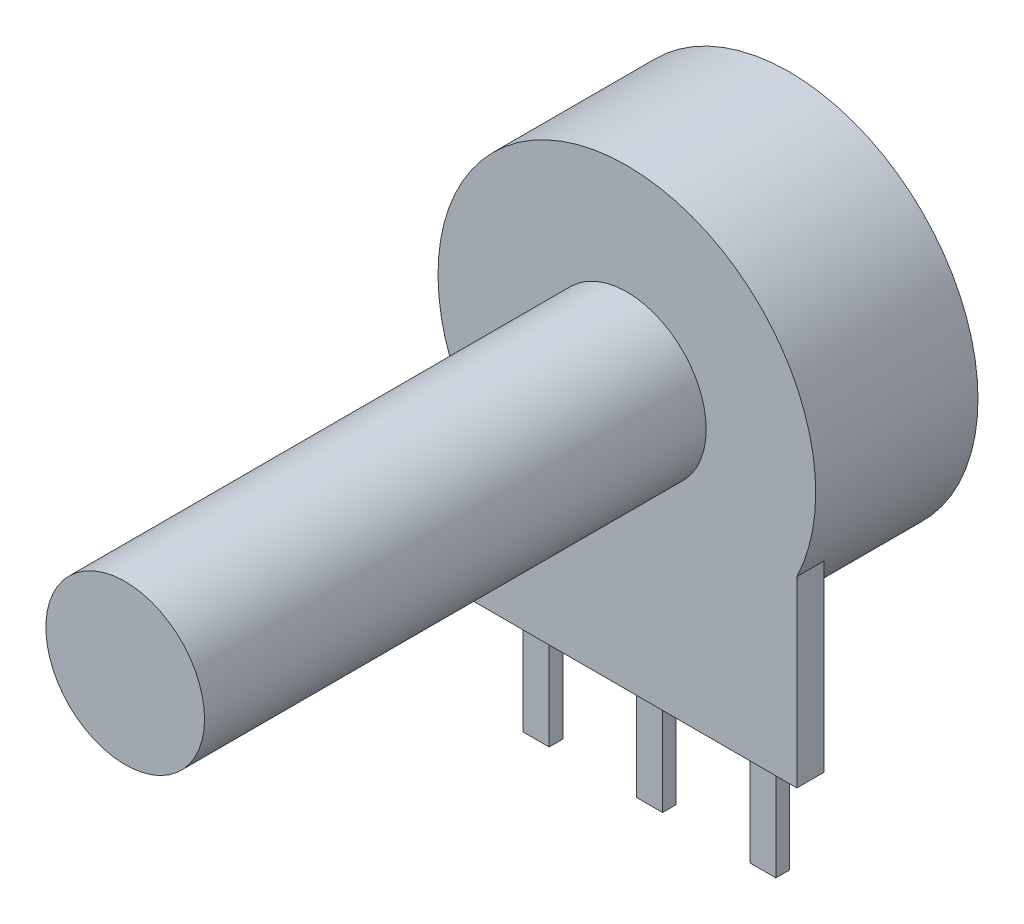
ISO-10303-21;
HEADER;
FILE_DESCRIPTION(('STEP AP214'),'2;1');
FILE_NAME('part.step','',(''),(''),'','','');
FILE_SCHEMA(('AUTOMOTIVE_DESIGN { 1 0 10303 214 1 1 1 1 }'));
ENDSEC;
DATA;
#1=APPLICATION_CONTEXT('core data for automotive mechanical design processes');
#2=APPLICATION_PROTOCOL_DEFINITION('international standard','automotive_design',2000,#1);
#3=PRODUCT_CONTEXT('',#1,'mechanical');
#4=PRODUCT('Part','Part','',(#3));
#5=PRODUCT_RELATED_PRODUCT_CATEGORY('part','',(#4));
#6=PRODUCT_DEFINITION_FORMATION('','',#4);
#7=PRODUCT_DEFINITION_CONTEXT('part definition',#1,'design');
#8=PRODUCT_DEFINITION('design','',#6,#7);
#9=PRODUCT_DEFINITION_SHAPE('','',#8);
#10=(LENGTH_UNIT() NAMED_UNIT(*) SI_UNIT(.MILLI.,.METRE.));
#11=(NAMED_UNIT(*) PLANE_ANGLE_UNIT() SI_UNIT($,.RADIAN.));
#12=(NAMED_UNIT(*) SI_UNIT($,.STERADIAN.) SOLID_ANGLE_UNIT());
#13=UNCERTAINTY_MEASURE_WITH_UNIT(LENGTH_MEASURE(1.E-05),#10,'distance_accuracy_value','');
#14=(GEOMETRIC_REPRESENTATION_CONTEXT(3) GLOBAL_UNCERTAINTY_ASSIGNED_CONTEXT((#13)) GLOBAL_UNIT_ASSIGNED_CONTEXT((#10,
#11,#12)) REPRESENTATION_CONTEXT('',''));
#15=CARTESIAN_POINT('',(0.,0.,0.));
#16=DIRECTION('',(0.,0.,1.));
#17=DIRECTION('',(1.,0.,0.));
#18=AXIS2_PLACEMENT_3D('',#15,#16,#17);
#19=CARTESIAN_POINT('',(0.,0.,7.16));
#20=DIRECTION('',(0.,0.,-1.));
#21=DIRECTION('',(-1.,0.,0.));
#22=AXIS2_PLACEMENT_3D('',#19,#20,#21);
#23=CYLINDRICAL_SURFACE('',#22,8.33);
#24=CARTESIAN_POINT('',(0.,0.,7.16));
#25=DIRECTION('',(0.,0.,1.));
#26=DIRECTION('',(1.,0.,0.));
#27=AXIS2_PLACEMENT_3D('',#24,#25,#26);
#28=CIRCLE('',#27,8.33);
#29=CARTESIAN_POINT('',(7.5,-3.62476206115657,7.16));
#30=VERTEX_POINT('',#29);
#31=CARTESIAN_POINT('',(-7.5,-3.62476206115657,7.16));
#32=VERTEX_POINT('',#31);
#33=EDGE_CURVE('E307',#30,#32,#28,.T.);
#34=ORIENTED_EDGE('',*,*,#33,.F.);
#35=DIRECTION('',(0.,0.,-1.));
#36=VECTOR('',#35,1.);
#37=CARTESIAN_POINT('',(7.5,-3.62476206115657,7.16));
#38=LINE('',#37,#36);
#39=CARTESIAN_POINT('',(7.5,-3.62476206115657,5.96));
#40=VERTEX_POINT('',#39);
#41=EDGE_CURVE('E297',#30,#40,#38,.T.);
#42=ORIENTED_EDGE('',*,*,#41,.T.);
#43=CARTESIAN_POINT('',(0.,0.,5.96));
#44=DIRECTION('',(0.,0.,-1.));
#45=DIRECTION('',(-1.,0.,0.));
#46=AXIS2_PLACEMENT_3D('',#43,#44,#45);
#47=CIRCLE('',#46,8.33);
#48=CARTESIAN_POINT('',(-7.5,-3.62476206115657,5.96));
#49=VERTEX_POINT('',#48);
#50=EDGE_CURVE('E37',#40,#49,#47,.T.);
#51=ORIENTED_EDGE('',*,*,#50,.T.);
#52=DIRECTION('',(0.,0.,-1.));
#53=VECTOR('',#52,1.);
#54=CARTESIAN_POINT('',(-7.5,-3.62476206115657,7.16));
#55=LINE('',#54,#53);
#56=EDGE_CURVE('E292',#49,#32,#55,.F.);
#57=ORIENTED_EDGE('',*,*,#56,.T.);
#58=EDGE_LOOP('',(#34,#42,#51,#57));
#59=FACE_BOUND('',#58,.T.);
#60=CARTESIAN_POINT('',(0.,0.,0.));
#61=DIRECTION('',(0.,0.,1.));
#62=DIRECTION('',(1.,0.,0.));
#63=AXIS2_PLACEMENT_3D('',#60,#61,#62);
#64=CIRCLE('',#63,8.33);
#65=CARTESIAN_POINT('',(8.33,0.,0.));
#66=VERTEX_POINT('',#65);
#67=EDGE_CURVE('E303',#66,#66,#64,.T.);
#68=ORIENTED_EDGE('',*,*,#67,.T.);
#69=EDGE_LOOP('',(#68));
#70=FACE_BOUND('',#69,.T.);
#71=ADVANCED_FACE('F34',(#59,#70),#23,.T.);
#72=CARTESIAN_POINT('',(0.,0.,7.16));
#73=DIRECTION('',(0.,0.,1.));
#74=DIRECTION('',(1.,0.,0.));
#75=AXIS2_PLACEMENT_3D('',#72,#73,#74);
#76=PLANE('',#75);
#77=ORIENTED_EDGE('',*,*,#33,.T.);
#78=DIRECTION('',(0.,-1.,0.));
#79=VECTOR('',#78,1.);
#80=CARTESIAN_POINT('',(-7.5,-11.7,7.16));
#81=LINE('',#80,#79);
#82=CARTESIAN_POINT('',(-7.5,-11.7,7.16));
#83=VERTEX_POINT('',#82);
#84=EDGE_CURVE('E286',#32,#83,#81,.T.);
#85=ORIENTED_EDGE('',*,*,#84,.T.);
#86=DIRECTION('',(1.,0.,0.));
#87=VECTOR('',#86,1.);
#88=CARTESIAN_POINT('',(-7.5,-11.7,7.16));
#89=LINE('',#88,#87);
#90=CARTESIAN_POINT('',(7.5,-11.7,7.16));
#91=VERTEX_POINT('',#90);
#92=EDGE_CURVE('E276',#83,#91,#89,.T.);
#93=ORIENTED_EDGE('',*,*,#92,.T.);
#94=DIRECTION('',(0.,1.,0.));
#95=VECTOR('',#94,1.);
#96=CARTESIAN_POINT('',(7.5,-11.7,7.16));
#97=LINE('',#96,#95);
#98=EDGE_CURVE('E271',#91,#30,#97,.T.);
#99=ORIENTED_EDGE('',*,*,#98,.T.);
#100=EDGE_LOOP('',(#77,#85,#93,#99));
#101=FACE_BOUND('',#100,.T.);
#102=CARTESIAN_POINT('',(0.,0.,7.16));
#103=DIRECTION('',(0.,0.,1.));
#104=DIRECTION('',(1.,0.,0.));
#105=AXIS2_PLACEMENT_3D('',#102,#103,#104);
#106=CIRCLE('',#105,3.5);
#107=CARTESIAN_POINT('',(3.5,0.,7.16));
#108=VERTEX_POINT('',#107);
#109=EDGE_CURVE('E304',#108,#108,#106,.T.);
#110=ORIENTED_EDGE('',*,*,#109,.F.);
#111=EDGE_LOOP('',(#110));
#112=FACE_BOUND('',#111,.T.);
#113=ADVANCED_FACE('F316',(#101,#112),#76,.T.);
#114=CARTESIAN_POINT('',(0.,0.,0.));
#115=DIRECTION('',(0.,0.,1.));
#116=DIRECTION('',(1.,0.,0.));
#117=AXIS2_PLACEMENT_3D('',#114,#115,#116);
#118=PLANE('',#117);
#119=ORIENTED_EDGE('',*,*,#67,.F.);
#120=EDGE_LOOP('',(#119));
#121=FACE_BOUND('',#120,.T.);
#122=ADVANCED_FACE('F313',(#121),#118,.F.);
#123=CARTESIAN_POINT('',(0.,0.,29.29));
#124=DIRECTION('',(0.,0.,-1.));
#125=DIRECTION('',(-1.,0.,0.));
#126=AXIS2_PLACEMENT_3D('',#123,#124,#125);
#127=CYLINDRICAL_SURFACE('',#126,3.5);
#128=CARTESIAN_POINT('',(0.,0.,29.29));
#129=DIRECTION('',(0.,0.,1.));
#130=DIRECTION('',(1.,0.,0.));
#131=AXIS2_PLACEMENT_3D('',#128,#129,#130);
#132=CIRCLE('',#131,3.5);
#133=CARTESIAN_POINT('',(3.5,0.,29.29));
#134=VERTEX_POINT('',#133);
#135=EDGE_CURVE('E300',#134,#134,#132,.T.);
#136=ORIENTED_EDGE('',*,*,#135,.F.);
#137=EDGE_LOOP('',(#136));
#138=FACE_BOUND('',#137,.T.);
#139=ORIENTED_EDGE('',*,*,#109,.T.);
#140=EDGE_LOOP('',(#139));
#141=FACE_BOUND('',#140,.T.);
#142=ADVANCED_FACE('F315',(#138,#141),#127,.T.);
#143=CARTESIAN_POINT('',(0.,0.,29.29));
#144=DIRECTION('',(0.,0.,1.));
#145=DIRECTION('',(1.,0.,0.));
#146=AXIS2_PLACEMENT_3D('',#143,#144,#145);
#147=PLANE('',#146);
#148=ORIENTED_EDGE('',*,*,#135,.T.);
#149=EDGE_LOOP('',(#148));
#150=FACE_BOUND('',#149,.T.);
#151=ADVANCED_FACE('F321',(#150),#147,.T.);
#152=CARTESIAN_POINT('',(7.5,-11.7,5.96));
#153=DIRECTION('',(1.,0.,0.));
#154=DIRECTION('',(0.,0.,-1.));
#155=AXIS2_PLACEMENT_3D('',#152,#153,#154);
#156=PLANE('',#155);
#157=ORIENTED_EDGE('',*,*,#41,.F.);
#158=ORIENTED_EDGE('',*,*,#98,.F.);
#159=DIRECTION('',(0.,0.,1.));
#160=VECTOR('',#159,1.);
#161=CARTESIAN_POINT('',(7.5,-11.7,5.96));
#162=LINE('',#161,#160);
#163=CARTESIAN_POINT('',(7.5,-11.7,5.96));
#164=VERTEX_POINT('',#163);
#165=EDGE_CURVE('E290',#164,#91,#162,.T.);
#166=ORIENTED_EDGE('',*,*,#165,.F.);
#167=DIRECTION('',(0.,1.,0.));
#168=VECTOR('',#167,1.);
#169=CARTESIAN_POINT('',(7.5,-11.7,5.96));
#170=LINE('',#169,#168);
#171=EDGE_CURVE('E272',#164,#40,#170,.T.);
#172=ORIENTED_EDGE('',*,*,#171,.T.);
#173=EDGE_LOOP('',(#157,#158,#166,#172));
#174=FACE_BOUND('',#173,.T.);
#175=ADVANCED_FACE('F338',(#174),#156,.T.);
#176=CARTESIAN_POINT('',(-7.5,-11.7,5.96));
#177=DIRECTION('',(-1.,0.,0.));
#178=DIRECTION('',(0.,0.,1.));
#179=AXIS2_PLACEMENT_3D('',#176,#177,#178);
#180=PLANE('',#179);
#181=ORIENTED_EDGE('',*,*,#56,.F.);
#182=DIRECTION('',(0.,-1.,0.));
#183=VECTOR('',#182,1.);
#184=CARTESIAN_POINT('',(-7.5,-11.7,5.96));
#185=LINE('',#184,#183);
#186=CARTESIAN_POINT('',(-7.5,-11.7,5.96));
#187=VERTEX_POINT('',#186);
#188=EDGE_CURVE('E275',#49,#187,#185,.T.);
#189=ORIENTED_EDGE('',*,*,#188,.T.);
#190=DIRECTION('',(0.,0.,1.));
#191=VECTOR('',#190,1.);
#192=CARTESIAN_POINT('',(-7.5,-11.7,5.96));
#193=LINE('',#192,#191);
#194=EDGE_CURVE('E282',#187,#83,#193,.T.);
#195=ORIENTED_EDGE('',*,*,#194,.T.);
#196=ORIENTED_EDGE('',*,*,#84,.F.);
#197=EDGE_LOOP('',(#181,#189,#195,#196));
#198=FACE_BOUND('',#197,.T.);
#199=ADVANCED_FACE('F383',(#198),#180,.T.);
#200=CARTESIAN_POINT('',(-7.5,-11.7,5.96));
#201=DIRECTION('',(0.,-1.,0.));
#202=DIRECTION('',(1.,0.,0.));
#203=AXIS2_PLACEMENT_3D('',#200,#201,#202);
#204=PLANE('',#203);
#205=DIRECTION('',(0.,0.,1.));
#206=VECTOR('',#205,1.);
#207=CARTESIAN_POINT('',(4.425,-11.7,5.56));
#208=LINE('',#207,#206);
#209=CARTESIAN_POINT('',(4.425,-11.7,5.96));
#210=VERTEX_POINT('',#209);
#211=CARTESIAN_POINT('',(4.425,-11.7,6.16));
#212=VERTEX_POINT('',#211);
#213=EDGE_CURVE('E56',#210,#212,#208,.T.);
#214=ORIENTED_EDGE('',*,*,#213,.T.);
#215=DIRECTION('',(-1.,0.,0.));
#216=VECTOR('',#215,1.);
#217=CARTESIAN_POINT('',(5.,-11.7,6.16));
#218=LINE('',#217,#216);
#219=CARTESIAN_POINT('',(5.575,-11.7,6.16));
#220=VERTEX_POINT('',#219);
#221=EDGE_CURVE('E51',#220,#212,#218,.T.);
#222=ORIENTED_EDGE('',*,*,#221,.F.);
#223=DIRECTION('',(0.,0.,1.));
#224=VECTOR('',#223,1.);
#225=CARTESIAN_POINT('',(5.575,-11.7,5.56));
#226=LINE('',#225,#224);
#227=CARTESIAN_POINT('',(5.575,-11.7,5.96));
#228=VERTEX_POINT('',#227);
#229=EDGE_CURVE('E207',#228,#220,#226,.T.);
#230=ORIENTED_EDGE('',*,*,#229,.F.);
#231=DIRECTION('',(1.,0.,0.));
#232=VECTOR('',#231,1.);
#233=CARTESIAN_POINT('',(-7.5,-11.7,5.96));
#234=LINE('',#233,#232);
#235=EDGE_CURVE('E278',#228,#164,#234,.T.);
#236=ORIENTED_EDGE('',*,*,#235,.T.);
#237=ORIENTED_EDGE('',*,*,#165,.T.);
#238=ORIENTED_EDGE('',*,*,#92,.F.);
#239=ORIENTED_EDGE('',*,*,#194,.F.);
#240=CARTESIAN_POINT('',(-5.575,-11.7,5.96));
#241=VERTEX_POINT('',#240);
#242=EDGE_CURVE('E279',#187,#241,#234,.T.);
#243=ORIENTED_EDGE('',*,*,#242,.T.);
#244=DIRECTION('',(0.,0.,1.));
#245=VECTOR('',#244,1.);
#246=CARTESIAN_POINT('',(-5.575,-11.7,5.56));
#247=LINE('',#246,#245);
#248=CARTESIAN_POINT('',(-5.575,-11.7,6.16));
#249=VERTEX_POINT('',#248);
#250=EDGE_CURVE('E238',#241,#249,#247,.T.);
#251=ORIENTED_EDGE('',*,*,#250,.T.);
#252=DIRECTION('',(-1.,0.,0.));
#253=VECTOR('',#252,1.);
#254=CARTESIAN_POINT('',(-5.,-11.7,6.16));
#255=LINE('',#254,#253);
#256=CARTESIAN_POINT('',(-4.425,-11.7,6.16));
#257=VERTEX_POINT('',#256);
#258=EDGE_CURVE('E223',#257,#249,#255,.T.);
#259=ORIENTED_EDGE('',*,*,#258,.F.);
#260=DIRECTION('',(0.,0.,1.));
#261=VECTOR('',#260,1.);
#262=CARTESIAN_POINT('',(-4.425,-11.7,5.56));
#263=LINE('',#262,#261);
#264=CARTESIAN_POINT('',(-4.425,-11.7,5.96));
#265=VERTEX_POINT('',#264);
#266=EDGE_CURVE('E234',#265,#257,#263,.T.);
#267=ORIENTED_EDGE('',*,*,#266,.F.);
#268=CARTESIAN_POINT('',(-0.575,-11.7,5.96));
#269=VERTEX_POINT('',#268);
#270=EDGE_CURVE('E350',#265,#269,#234,.T.);
#271=ORIENTED_EDGE('',*,*,#270,.T.);
#272=DIRECTION('',(0.,0.,1.));
#273=VECTOR('',#272,1.);
#274=CARTESIAN_POINT('',(-0.575,-11.7,5.56));
#275=LINE('',#274,#273);
#276=CARTESIAN_POINT('',(-0.575,-11.7,6.16));
#277=VERTEX_POINT('',#276);
#278=EDGE_CURVE('E42',#269,#277,#275,.T.);
#279=ORIENTED_EDGE('',*,*,#278,.T.);
#280=DIRECTION('',(-1.,0.,0.));
#281=VECTOR('',#280,1.);
#282=CARTESIAN_POINT('',(0.,-11.7,6.16));
#283=LINE('',#282,#281);
#284=CARTESIAN_POINT('',(0.575,-11.7,6.16));
#285=VERTEX_POINT('',#284);
#286=EDGE_CURVE('E257',#285,#277,#283,.T.);
#287=ORIENTED_EDGE('',*,*,#286,.F.);
#288=DIRECTION('',(0.,0.,1.));
#289=VECTOR('',#288,1.);
#290=CARTESIAN_POINT('',(0.575,-11.7,5.56));
#291=LINE('',#290,#289);
#292=CARTESIAN_POINT('',(0.575,-11.7,5.96));
#293=VERTEX_POINT('',#292);
#294=EDGE_CURVE('E11',#293,#285,#291,.T.);
#295=ORIENTED_EDGE('',*,*,#294,.F.);
#296=EDGE_CURVE('E360',#293,#210,#234,.T.);
#297=ORIENTED_EDGE('',*,*,#296,.T.);
#298=EDGE_LOOP('',(#214,#222,#230,#236,#237,#238,#239,#243,#251,#259,#267,#271,#279,#287,#295,#297));
#299=FACE_BOUND('',#298,.T.);
#300=ADVANCED_FACE('F347',(#299),#204,.T.);
#301=CARTESIAN_POINT('',(0.,0.,5.96));
#302=DIRECTION('',(0.,0.,-1.));
#303=DIRECTION('',(-1.,0.,0.));
#304=AXIS2_PLACEMENT_3D('',#301,#302,#303);
#305=PLANE('',#304);
#306=ORIENTED_EDGE('',*,*,#50,.F.);
#307=ORIENTED_EDGE('',*,*,#171,.F.);
#308=ORIENTED_EDGE('',*,*,#235,.F.);
#309=EDGE_CURVE('E361',#210,#228,#234,.T.);
#310=ORIENTED_EDGE('',*,*,#309,.F.);
#311=ORIENTED_EDGE('',*,*,#296,.F.);
#312=EDGE_CURVE('E284',#269,#293,#234,.T.);
#313=ORIENTED_EDGE('',*,*,#312,.F.);
#314=ORIENTED_EDGE('',*,*,#270,.F.);
#315=EDGE_CURVE('E283',#241,#265,#234,.T.);
#316=ORIENTED_EDGE('',*,*,#315,.F.);
#317=ORIENTED_EDGE('',*,*,#242,.F.);
#318=ORIENTED_EDGE('',*,*,#188,.F.);
#319=EDGE_LOOP('',(#306,#307,#308,#310,#311,#313,#314,#316,#317,#318));
#320=FACE_BOUND('',#319,.T.);
#321=ADVANCED_FACE('F341',(#320),#305,.T.);
#322=CARTESIAN_POINT('',(-0.575,0.,5.56));
#323=DIRECTION('',(-1.,0.,0.));
#324=DIRECTION('',(0.,0.,1.));
#325=AXIS2_PLACEMENT_3D('',#322,#323,#324);
#326=PLANE('',#325);
#327=DIRECTION('',(0.,-1.,0.));
#328=VECTOR('',#327,1.);
#329=CARTESIAN_POINT('',(-0.575,0.,6.16));
#330=LINE('',#329,#328);
#331=CARTESIAN_POINT('',(-0.575,-16.6,6.16));
#332=VERTEX_POINT('',#331);
#333=EDGE_CURVE('E242',#277,#332,#330,.T.);
#334=ORIENTED_EDGE('',*,*,#333,.F.);
#335=ORIENTED_EDGE('',*,*,#278,.F.);
#336=CARTESIAN_POINT('',(-0.575,-11.7,5.56));
#337=VERTEX_POINT('',#336);
#338=EDGE_CURVE('E268',#337,#269,#275,.T.);
#339=ORIENTED_EDGE('',*,*,#338,.F.);
#340=DIRECTION('',(0.,-1.,0.));
#341=VECTOR('',#340,1.);
#342=CARTESIAN_POINT('',(-0.575,0.,5.56));
#343=LINE('',#342,#341);
#344=CARTESIAN_POINT('',(-0.575,-16.6,5.56));
#345=VERTEX_POINT('',#344);
#346=EDGE_CURVE('E243',#337,#345,#343,.T.);
#347=ORIENTED_EDGE('',*,*,#346,.T.);
#348=DIRECTION('',(0.,0.,1.));
#349=VECTOR('',#348,1.);
#350=CARTESIAN_POINT('',(-0.575,-16.6,5.56));
#351=LINE('',#350,#349);
#352=EDGE_CURVE('E254',#345,#332,#351,.T.);
#353=ORIENTED_EDGE('',*,*,#352,.T.);
#354=EDGE_LOOP('',(#334,#335,#339,#347,#353));
#355=FACE_BOUND('',#354,.T.);
#356=ADVANCED_FACE('F353',(#355),#326,.T.);
#357=CARTESIAN_POINT('',(0.,-11.7,5.56));
#358=DIRECTION('',(0.,1.,0.));
#359=DIRECTION('',(-1.,0.,0.));
#360=AXIS2_PLACEMENT_3D('',#357,#358,#359);
#361=PLANE('',#360);
#362=ORIENTED_EDGE('',*,*,#338,.T.);
#363=ORIENTED_EDGE('',*,*,#312,.T.);
#364=CARTESIAN_POINT('',(0.575,-11.7,5.56));
#365=VERTEX_POINT('',#364);
#366=EDGE_CURVE('E44',#365,#293,#291,.T.);
#367=ORIENTED_EDGE('',*,*,#366,.F.);
#368=DIRECTION('',(-1.,0.,0.));
#369=VECTOR('',#368,1.);
#370=CARTESIAN_POINT('',(0.,-11.7,5.56));
#371=LINE('',#370,#369);
#372=EDGE_CURVE('E246',#365,#337,#371,.T.);
#373=ORIENTED_EDGE('',*,*,#372,.T.);
#374=EDGE_LOOP('',(#362,#363,#367,#373));
#375=FACE_BOUND('',#374,.T.);
#376=ADVANCED_FACE('F357',(#375),#361,.T.);
#377=CARTESIAN_POINT('',(0.575,0.,5.56));
#378=DIRECTION('',(-1.,0.,0.));
#379=DIRECTION('',(0.,0.,1.));
#380=AXIS2_PLACEMENT_3D('',#377,#378,#379);
#381=PLANE('',#380);
#382=DIRECTION('',(0.,-1.,0.));
#383=VECTOR('',#382,1.);
#384=CARTESIAN_POINT('',(0.575,0.,6.16));
#385=LINE('',#384,#383);
#386=CARTESIAN_POINT('',(0.575,-16.6,6.16));
#387=VERTEX_POINT('',#386);
#388=EDGE_CURVE('E259',#285,#387,#385,.T.);
#389=ORIENTED_EDGE('',*,*,#388,.T.);
#390=DIRECTION('',(0.,0.,1.));
#391=VECTOR('',#390,1.);
#392=CARTESIAN_POINT('',(0.575,-16.6,5.56));
#393=LINE('',#392,#391);
#394=CARTESIAN_POINT('',(0.575,-16.6,5.56));
#395=VERTEX_POINT('',#394);
#396=EDGE_CURVE('E264',#395,#387,#393,.T.);
#397=ORIENTED_EDGE('',*,*,#396,.F.);
#398=DIRECTION('',(0.,-1.,0.));
#399=VECTOR('',#398,1.);
#400=CARTESIAN_POINT('',(0.575,0.,5.56));
#401=LINE('',#400,#399);
#402=EDGE_CURVE('E250',#365,#395,#401,.T.);
#403=ORIENTED_EDGE('',*,*,#402,.F.);
#404=ORIENTED_EDGE('',*,*,#366,.T.);
#405=ORIENTED_EDGE('',*,*,#294,.T.);
#406=EDGE_LOOP('',(#389,#397,#403,#404,#405));
#407=FACE_BOUND('',#406,.T.);
#408=ADVANCED_FACE('F436',(#407),#381,.F.);
#409=CARTESIAN_POINT('',(0.,-16.6,5.56));
#410=DIRECTION('',(0.,1.,0.));
#411=DIRECTION('',(0.,0.,1.));
#412=AXIS2_PLACEMENT_3D('',#409,#410,#411);
#413=PLANE('',#412);
#414=DIRECTION('',(-1.,0.,0.));
#415=VECTOR('',#414,1.);
#416=CARTESIAN_POINT('',(0.,-16.6,6.16));
#417=LINE('',#416,#415);
#418=EDGE_CURVE('E247',#387,#332,#417,.T.);
#419=ORIENTED_EDGE('',*,*,#418,.T.);
#420=ORIENTED_EDGE('',*,*,#352,.F.);
#421=DIRECTION('',(-1.,0.,0.));
#422=VECTOR('',#421,1.);
#423=CARTESIAN_POINT('',(0.,-16.6,5.56));
#424=LINE('',#423,#422);
#425=EDGE_CURVE('E252',#395,#345,#424,.T.);
#426=ORIENTED_EDGE('',*,*,#425,.F.);
#427=ORIENTED_EDGE('',*,*,#396,.T.);
#428=EDGE_LOOP('',(#419,#420,#426,#427));
#429=FACE_BOUND('',#428,.T.);
#430=ADVANCED_FACE('F445',(#429),#413,.F.);
#431=CARTESIAN_POINT('',(0.,0.,5.56));
#432=DIRECTION('',(0.,0.,-1.));
#433=DIRECTION('',(-1.,0.,0.));
#434=AXIS2_PLACEMENT_3D('',#431,#432,#433);
#435=PLANE('',#434);
#436=ORIENTED_EDGE('',*,*,#346,.F.);
#437=ORIENTED_EDGE('',*,*,#372,.F.);
#438=ORIENTED_EDGE('',*,*,#402,.T.);
#439=ORIENTED_EDGE('',*,*,#425,.T.);
#440=EDGE_LOOP('',(#436,#437,#438,#439));
#441=FACE_BOUND('',#440,.T.);
#442=ADVANCED_FACE('F455',(#441),#435,.T.);
#443=CARTESIAN_POINT('',(0.,0.,6.16));
#444=DIRECTION('',(0.,0.,-1.));
#445=DIRECTION('',(-1.,0.,0.));
#446=AXIS2_PLACEMENT_3D('',#443,#444,#445);
#447=PLANE('',#446);
#448=ORIENTED_EDGE('',*,*,#333,.T.);
#449=ORIENTED_EDGE('',*,*,#418,.F.);
#450=ORIENTED_EDGE('',*,*,#388,.F.);
#451=ORIENTED_EDGE('',*,*,#286,.T.);
#452=EDGE_LOOP('',(#448,#449,#450,#451));
#453=FACE_BOUND('',#452,.T.);
#454=ADVANCED_FACE('F465',(#453),#447,.F.);
#455=CARTESIAN_POINT('',(-5.575,0.,5.56));
#456=DIRECTION('',(-1.,0.,0.));
#457=DIRECTION('',(0.,0.,1.));
#458=AXIS2_PLACEMENT_3D('',#455,#456,#457);
#459=PLANE('',#458);
#460=DIRECTION('',(0.,-1.,0.));
#461=VECTOR('',#460,1.);
#462=CARTESIAN_POINT('',(-5.575,0.,6.16));
#463=LINE('',#462,#461);
#464=CARTESIAN_POINT('',(-5.575,-16.6,6.16));
#465=VERTEX_POINT('',#464);
#466=EDGE_CURVE('E174',#249,#465,#463,.T.);
#467=ORIENTED_EDGE('',*,*,#466,.F.);
#468=ORIENTED_EDGE('',*,*,#250,.F.);
#469=CARTESIAN_POINT('',(-5.575,-11.7,5.56));
#470=VERTEX_POINT('',#469);
#471=EDGE_CURVE('E239',#470,#241,#247,.T.);
#472=ORIENTED_EDGE('',*,*,#471,.F.);
#473=DIRECTION('',(0.,-1.,0.));
#474=VECTOR('',#473,1.);
#475=CARTESIAN_POINT('',(-5.575,0.,5.56));
#476=LINE('',#475,#474);
#477=CARTESIAN_POINT('',(-5.575,-16.6,5.56));
#478=VERTEX_POINT('',#477);
#479=EDGE_CURVE('E209',#470,#478,#476,.T.);
#480=ORIENTED_EDGE('',*,*,#479,.T.);
#481=DIRECTION('',(0.,0.,1.));
#482=VECTOR('',#481,1.);
#483=CARTESIAN_POINT('',(-5.575,-16.6,5.56));
#484=LINE('',#483,#482);
#485=EDGE_CURVE('E220',#478,#465,#484,.T.);
#486=ORIENTED_EDGE('',*,*,#485,.T.);
#487=EDGE_LOOP('',(#467,#468,#472,#480,#486));
#488=FACE_BOUND('',#487,.T.);
#489=ADVANCED_FACE('F379',(#488),#459,.T.);
#490=CARTESIAN_POINT('',(-5.,-11.7,5.56));
#491=DIRECTION('',(0.,1.,0.));
#492=DIRECTION('',(-1.,0.,0.));
#493=AXIS2_PLACEMENT_3D('',#490,#491,#492);
#494=PLANE('',#493);
#495=ORIENTED_EDGE('',*,*,#471,.T.);
#496=ORIENTED_EDGE('',*,*,#315,.T.);
#497=CARTESIAN_POINT('',(-4.425,-11.7,5.56));
#498=VERTEX_POINT('',#497);
#499=EDGE_CURVE('E235',#498,#265,#263,.T.);
#500=ORIENTED_EDGE('',*,*,#499,.F.);
#501=DIRECTION('',(-1.,0.,0.));
#502=VECTOR('',#501,1.);
#503=CARTESIAN_POINT('',(-5.,-11.7,5.56));
#504=LINE('',#503,#502);
#505=EDGE_CURVE('E212',#498,#470,#504,.T.);
#506=ORIENTED_EDGE('',*,*,#505,.T.);
#507=EDGE_LOOP('',(#495,#496,#500,#506));
#508=FACE_BOUND('',#507,.T.);
#509=ADVANCED_FACE('F364',(#508),#494,.T.);
#510=CARTESIAN_POINT('',(-4.425,0.,5.56));
#511=DIRECTION('',(-1.,0.,0.));
#512=DIRECTION('',(0.,0.,1.));
#513=AXIS2_PLACEMENT_3D('',#510,#511,#512);
#514=PLANE('',#513);
#515=DIRECTION('',(0.,-1.,0.));
#516=VECTOR('',#515,1.);
#517=CARTESIAN_POINT('',(-4.425,0.,6.16));
#518=LINE('',#517,#516);
#519=CARTESIAN_POINT('',(-4.425,-16.6,6.16));
#520=VERTEX_POINT('',#519);
#521=EDGE_CURVE('E226',#257,#520,#518,.T.);
#522=ORIENTED_EDGE('',*,*,#521,.T.);
#523=DIRECTION('',(0.,0.,1.));
#524=VECTOR('',#523,1.);
#525=CARTESIAN_POINT('',(-4.425,-16.6,5.56));
#526=LINE('',#525,#524);
#527=CARTESIAN_POINT('',(-4.425,-16.6,5.56));
#528=VERTEX_POINT('',#527);
#529=EDGE_CURVE('E231',#528,#520,#526,.T.);
#530=ORIENTED_EDGE('',*,*,#529,.F.);
#531=DIRECTION('',(0.,-1.,0.));
#532=VECTOR('',#531,1.);
#533=CARTESIAN_POINT('',(-4.425,0.,5.56));
#534=LINE('',#533,#532);
#535=EDGE_CURVE('E216',#498,#528,#534,.T.);
#536=ORIENTED_EDGE('',*,*,#535,.F.);
#537=ORIENTED_EDGE('',*,*,#499,.T.);
#538=ORIENTED_EDGE('',*,*,#266,.T.);
#539=EDGE_LOOP('',(#522,#530,#536,#537,#538));
#540=FACE_BOUND('',#539,.T.);
#541=ADVANCED_FACE('F368',(#540),#514,.F.);
#542=CARTESIAN_POINT('',(-5.,-16.6,5.56));
#543=DIRECTION('',(0.,1.,0.));
#544=DIRECTION('',(0.,0.,1.));
#545=AXIS2_PLACEMENT_3D('',#542,#543,#544);
#546=PLANE('',#545);
#547=DIRECTION('',(-1.,0.,0.));
#548=VECTOR('',#547,1.);
#549=CARTESIAN_POINT('',(-5.,-16.6,6.16));
#550=LINE('',#549,#548);
#551=EDGE_CURVE('E213',#520,#465,#550,.T.);
#552=ORIENTED_EDGE('',*,*,#551,.T.);
#553=ORIENTED_EDGE('',*,*,#485,.F.);
#554=DIRECTION('',(-1.,0.,0.));
#555=VECTOR('',#554,1.);
#556=CARTESIAN_POINT('',(-5.,-16.6,5.56));
#557=LINE('',#556,#555);
#558=EDGE_CURVE('E218',#528,#478,#557,.T.);
#559=ORIENTED_EDGE('',*,*,#558,.F.);
#560=ORIENTED_EDGE('',*,*,#529,.T.);
#561=EDGE_LOOP('',(#552,#553,#559,#560));
#562=FACE_BOUND('',#561,.T.);
#563=ADVANCED_FACE('F511',(#562),#546,.F.);
#564=CARTESIAN_POINT('',(-5.,0.,5.56));
#565=DIRECTION('',(0.,0.,-1.));
#566=DIRECTION('',(-1.,0.,0.));
#567=AXIS2_PLACEMENT_3D('',#564,#565,#566);
#568=PLANE('',#567);
#569=ORIENTED_EDGE('',*,*,#479,.F.);
#570=ORIENTED_EDGE('',*,*,#505,.F.);
#571=ORIENTED_EDGE('',*,*,#535,.T.);
#572=ORIENTED_EDGE('',*,*,#558,.T.);
#573=EDGE_LOOP('',(#569,#570,#571,#572));
#574=FACE_BOUND('',#573,.T.);
#575=ADVANCED_FACE('F375',(#574),#568,.T.);
#576=CARTESIAN_POINT('',(-5.,0.,6.16));
#577=DIRECTION('',(0.,0.,-1.));
#578=DIRECTION('',(-1.,0.,0.));
#579=AXIS2_PLACEMENT_3D('',#576,#577,#578);
#580=PLANE('',#579);
#581=ORIENTED_EDGE('',*,*,#466,.T.);
#582=ORIENTED_EDGE('',*,*,#551,.F.);
#583=ORIENTED_EDGE('',*,*,#521,.F.);
#584=ORIENTED_EDGE('',*,*,#258,.T.);
#585=EDGE_LOOP('',(#581,#582,#583,#584));
#586=FACE_BOUND('',#585,.T.);
#587=ADVANCED_FACE('F529',(#586),#580,.F.);
#588=CARTESIAN_POINT('',(4.425,0.,5.56));
#589=DIRECTION('',(-1.,0.,0.));
#590=DIRECTION('',(0.,0.,1.));
#591=AXIS2_PLACEMENT_3D('',#588,#589,#590);
#592=PLANE('',#591);
#593=DIRECTION('',(0.,-1.,0.));
#594=VECTOR('',#593,1.);
#595=CARTESIAN_POINT('',(4.425,0.,6.16));
#596=LINE('',#595,#594);
#597=CARTESIAN_POINT('',(4.425,-16.6,6.16));
#598=VERTEX_POINT('',#597);
#599=EDGE_CURVE('E195',#212,#598,#596,.T.);
#600=ORIENTED_EDGE('',*,*,#599,.F.);
#601=ORIENTED_EDGE('',*,*,#213,.F.);
#602=CARTESIAN_POINT('',(4.425,-11.7,5.56));
#603=VERTEX_POINT('',#602);
#604=EDGE_CURVE('E167',#603,#210,#208,.T.);
#605=ORIENTED_EDGE('',*,*,#604,.F.);
#606=DIRECTION('',(0.,-1.,0.));
#607=VECTOR('',#606,1.);
#608=CARTESIAN_POINT('',(4.425,0.,5.56));
#609=LINE('',#608,#607);
#610=CARTESIAN_POINT('',(4.425,-16.6,5.56));
#611=VERTEX_POINT('',#610);
#612=EDGE_CURVE('E170',#603,#611,#609,.T.);
#613=ORIENTED_EDGE('',*,*,#612,.T.);
#614=DIRECTION('',(0.,0.,1.));
#615=VECTOR('',#614,1.);
#616=CARTESIAN_POINT('',(4.425,-16.6,5.56));
#617=LINE('',#616,#615);
#618=EDGE_CURVE('E194',#611,#598,#617,.T.);
#619=ORIENTED_EDGE('',*,*,#618,.T.);
#620=EDGE_LOOP('',(#600,#601,#605,#613,#619));
#621=FACE_BOUND('',#620,.T.);
#622=ADVANCED_FACE('F169',(#621),#592,.T.);
#623=CARTESIAN_POINT('',(5.,-11.7,5.56));
#624=DIRECTION('',(0.,1.,0.));
#625=DIRECTION('',(-1.,0.,0.));
#626=AXIS2_PLACEMENT_3D('',#623,#624,#625);
#627=PLANE('',#626);
#628=ORIENTED_EDGE('',*,*,#604,.T.);
#629=ORIENTED_EDGE('',*,*,#309,.T.);
#630=CARTESIAN_POINT('',(5.575,-11.7,5.56));
#631=VERTEX_POINT('',#630);
#632=EDGE_CURVE('E187',#631,#228,#226,.T.);
#633=ORIENTED_EDGE('',*,*,#632,.F.);
#634=DIRECTION('',(-1.,0.,0.));
#635=VECTOR('',#634,1.);
#636=CARTESIAN_POINT('',(5.,-11.7,5.56));
#637=LINE('',#636,#635);
#638=EDGE_CURVE('E179',#631,#603,#637,.T.);
#639=ORIENTED_EDGE('',*,*,#638,.T.);
#640=EDGE_LOOP('',(#628,#629,#633,#639));
#641=FACE_BOUND('',#640,.T.);
#642=ADVANCED_FACE('F185',(#641),#627,.T.);
#643=CARTESIAN_POINT('',(5.575,0.,5.56));
#644=DIRECTION('',(-1.,0.,0.));
#645=DIRECTION('',(0.,0.,1.));
#646=AXIS2_PLACEMENT_3D('',#643,#644,#645);
#647=PLANE('',#646);
#648=DIRECTION('',(0.,-1.,0.));
#649=VECTOR('',#648,1.);
#650=CARTESIAN_POINT('',(5.575,0.,6.16));
#651=LINE('',#650,#649);
#652=CARTESIAN_POINT('',(5.575,-16.6,6.16));
#653=VERTEX_POINT('',#652);
#654=EDGE_CURVE('E199',#220,#653,#651,.T.);
#655=ORIENTED_EDGE('',*,*,#654,.T.);
#656=DIRECTION('',(0.,0.,1.));
#657=VECTOR('',#656,1.);
#658=CARTESIAN_POINT('',(5.575,-16.6,5.56));
#659=LINE('',#658,#657);
#660=CARTESIAN_POINT('',(5.575,-16.6,5.56));
#661=VERTEX_POINT('',#660);
#662=EDGE_CURVE('E204',#661,#653,#659,.T.);
#663=ORIENTED_EDGE('',*,*,#662,.F.);
#664=DIRECTION('',(0.,-1.,0.));
#665=VECTOR('',#664,1.);
#666=CARTESIAN_POINT('',(5.575,0.,5.56));
#667=LINE('',#666,#665);
#668=EDGE_CURVE('E189',#631,#661,#667,.T.);
#669=ORIENTED_EDGE('',*,*,#668,.F.);
#670=ORIENTED_EDGE('',*,*,#632,.T.);
#671=ORIENTED_EDGE('',*,*,#229,.T.);
#672=EDGE_LOOP('',(#655,#663,#669,#670,#671));
#673=FACE_BOUND('',#672,.T.);
#674=ADVANCED_FACE('F556',(#673),#647,.F.);
#675=CARTESIAN_POINT('',(5.,-16.6,5.56));
#676=DIRECTION('',(0.,1.,0.));
#677=DIRECTION('',(0.,0.,1.));
#678=AXIS2_PLACEMENT_3D('',#675,#676,#677);
#679=PLANE('',#678);
#680=DIRECTION('',(-1.,0.,0.));
#681=VECTOR('',#680,1.);
#682=CARTESIAN_POINT('',(5.,-16.6,6.16));
#683=LINE('',#682,#681);
#684=EDGE_CURVE('E183',#653,#598,#683,.T.);
#685=ORIENTED_EDGE('',*,*,#684,.T.);
#686=ORIENTED_EDGE('',*,*,#618,.F.);
#687=DIRECTION('',(-1.,0.,0.));
#688=VECTOR('',#687,1.);
#689=CARTESIAN_POINT('',(5.,-16.6,5.56));
#690=LINE('',#689,#688);
#691=EDGE_CURVE('E181',#661,#611,#690,.T.);
#692=ORIENTED_EDGE('',*,*,#691,.F.);
#693=ORIENTED_EDGE('',*,*,#662,.T.);
#694=EDGE_LOOP('',(#685,#686,#692,#693));
#695=FACE_BOUND('',#694,.T.);
#696=ADVANCED_FACE('F565',(#695),#679,.F.);
#697=CARTESIAN_POINT('',(5.,0.,5.56));
#698=DIRECTION('',(0.,0.,-1.));
#699=DIRECTION('',(-1.,0.,0.));
#700=AXIS2_PLACEMENT_3D('',#697,#698,#699);
#701=PLANE('',#700);
#702=ORIENTED_EDGE('',*,*,#612,.F.);
#703=ORIENTED_EDGE('',*,*,#638,.F.);
#704=ORIENTED_EDGE('',*,*,#668,.T.);
#705=ORIENTED_EDGE('',*,*,#691,.T.);
#706=EDGE_LOOP('',(#702,#703,#704,#705));
#707=FACE_BOUND('',#706,.T.);
#708=ADVANCED_FACE('F178',(#707),#701,.T.);
#709=CARTESIAN_POINT('',(5.,0.,6.16));
#710=DIRECTION('',(0.,0.,-1.));
#711=DIRECTION('',(-1.,0.,0.));
#712=AXIS2_PLACEMENT_3D('',#709,#710,#711);
#713=PLANE('',#712);
#714=ORIENTED_EDGE('',*,*,#599,.T.);
#715=ORIENTED_EDGE('',*,*,#684,.F.);
#716=ORIENTED_EDGE('',*,*,#654,.F.);
#717=ORIENTED_EDGE('',*,*,#221,.T.);
#718=EDGE_LOOP('',(#714,#715,#716,#717));
#719=FACE_BOUND('',#718,.T.);
#720=ADVANCED_FACE('F584',(#719),#713,.F.);
#721=CLOSED_SHELL('',(#71,#113,#122,#142,#151,#175,#199,#300,#321,#356,#376,#408,#430,#442,#454,
#489,#509,#541,#563,#575,#587,#622,#642,#674,#696,#708,#720));
#722=MANIFOLD_SOLID_BREP('B2',#721);
#723=ADVANCED_BREP_SHAPE_REPRESENTATION('',(#18,#722),#14);
#724=SHAPE_DEFINITION_REPRESENTATION(#9,#723);
ENDSEC;
END-ISO-10303-21;
